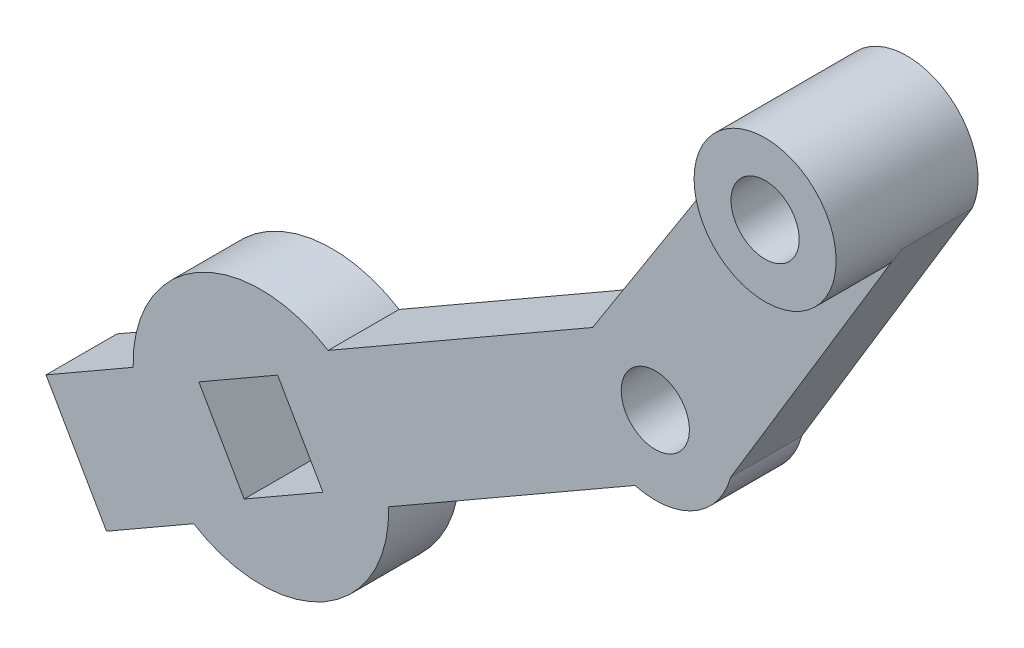
ISO-10303-21;
HEADER;
FILE_DESCRIPTION(('STEP AP214'),'2;1');
FILE_NAME('part.step','',(''),(''),'','','');
FILE_SCHEMA(('AUTOMOTIVE_DESIGN { 1 0 10303 214 1 1 1 1 }'));
ENDSEC;
DATA;
#1=APPLICATION_CONTEXT('core data for automotive mechanical design processes');
#2=APPLICATION_PROTOCOL_DEFINITION('international standard','automotive_design',2000,#1);
#3=PRODUCT_CONTEXT('',#1,'mechanical');
#4=PRODUCT('Part','Part','',(#3));
#5=PRODUCT_RELATED_PRODUCT_CATEGORY('part','',(#4));
#6=PRODUCT_DEFINITION_FORMATION('','',#4);
#7=PRODUCT_DEFINITION_CONTEXT('part definition',#1,'design');
#8=PRODUCT_DEFINITION('design','',#6,#7);
#9=PRODUCT_DEFINITION_SHAPE('','',#8);
#10=(LENGTH_UNIT() NAMED_UNIT(*) SI_UNIT(.MILLI.,.METRE.));
#11=(NAMED_UNIT(*) PLANE_ANGLE_UNIT() SI_UNIT($,.RADIAN.));
#12=(NAMED_UNIT(*) SI_UNIT($,.STERADIAN.) SOLID_ANGLE_UNIT());
#13=UNCERTAINTY_MEASURE_WITH_UNIT(LENGTH_MEASURE(1.E-05),#10,'distance_accuracy_value','');
#14=(GEOMETRIC_REPRESENTATION_CONTEXT(3) GLOBAL_UNCERTAINTY_ASSIGNED_CONTEXT((#13)) GLOBAL_UNIT_ASSIGNED_CONTEXT((#10,
#11,#12)) REPRESENTATION_CONTEXT('',''));
#15=CARTESIAN_POINT('',(0.,0.,0.));
#16=DIRECTION('',(0.,0.,1.));
#17=DIRECTION('',(1.,0.,0.));
#18=AXIS2_PLACEMENT_3D('',#15,#16,#17);
#19=CARTESIAN_POINT('',(0.17625658415401,-0.30648591573246,-5.));
#20=DIRECTION('',(-0.498528903536302,0.866873077410351,0.));
#21=DIRECTION('',(-0.866873077410351,-0.498528903536302,0.));
#22=AXIS2_PLACEMENT_3D('',#19,#20,#21);
#23=PLANE('',#22);
#24=DIRECTION('',(0.,0.,1.));
#25=VECTOR('',#24,1.);
#26=CARTESIAN_POINT('',(-20.556729316369,-12.2297916422161,-30.4558441227157));
#27=LINE('',#26,#25);
#28=CARTESIAN_POINT('',(-20.556729316369,-12.2297916422161,-5.));
#29=VERTEX_POINT('',#28);
#30=CARTESIAN_POINT('',(-20.556729316369,-12.2297916422161,0.));
#31=VERTEX_POINT('',#30);
#32=EDGE_CURVE('E171',#29,#31,#27,.T.);
#33=ORIENTED_EDGE('',*,*,#32,.T.);
#34=DIRECTION('',(0.866873077410351,0.498528903536302,0.));
#35=VECTOR('',#34,1.);
#36=CARTESIAN_POINT('',(0.17625658415401,-0.30648591573246,0.));
#37=LINE('',#36,#35);
#38=CARTESIAN_POINT('',(-1.93424021867878,-1.52020875988425,0.));
#39=VERTEX_POINT('',#38);
#40=EDGE_CURVE('E170',#31,#39,#37,.T.);
#41=ORIENTED_EDGE('',*,*,#40,.T.);
#42=DIRECTION('',(0.,0.,1.));
#43=VECTOR('',#42,1.);
#44=CARTESIAN_POINT('',(-1.93424021867878,-1.52020875988425,-5.));
#45=LINE('',#44,#43);
#46=CARTESIAN_POINT('',(-1.93424021867878,-1.52020875988425,-5.));
#47=VERTEX_POINT('',#46);
#48=EDGE_CURVE('E41',#47,#39,#45,.T.);
#49=ORIENTED_EDGE('',*,*,#48,.F.);
#50=DIRECTION('',(0.866873077410351,0.498528903536302,0.));
#51=VECTOR('',#50,1.);
#52=CARTESIAN_POINT('',(0.17625658415401,-0.30648591573246,-5.));
#53=LINE('',#52,#51);
#54=EDGE_CURVE('E241',#29,#47,#53,.T.);
#55=ORIENTED_EDGE('',*,*,#54,.F.);
#56=EDGE_LOOP('',(#33,#41,#49,#55));
#57=FACE_BOUND('',#56,.T.);
#58=ADVANCED_FACE('F37',(#57),#23,.T.);
#59=CARTESIAN_POINT('',(4.43647181358803,-7.71441323985198,-5.));
#60=DIRECTION('',(-0.498528903536302,0.866873077410351,0.));
#61=DIRECTION('',(-0.866873077410351,-0.498528903536302,0.));
#62=AXIS2_PLACEMENT_3D('',#59,#60,#61);
#63=PLANE('',#62);
#64=DIRECTION('',(0.866873077410351,0.498528903536302,0.));
#65=VECTOR('',#64,1.);
#66=CARTESIAN_POINT('',(4.43647181358803,-7.71441323985198,-5.));
#67=LINE('',#66,#65);
#68=CARTESIAN_POINT('',(-16.296514086935,-19.6377189663356,-5.));
#69=VERTEX_POINT('',#68);
#70=CARTESIAN_POINT('',(1.04782478556533,-9.66318582418271,-5.));
#71=VERTEX_POINT('',#70);
#72=EDGE_CURVE('E244',#69,#71,#67,.T.);
#73=ORIENTED_EDGE('',*,*,#72,.T.);
#74=DIRECTION('',(0.,0.,1.));
#75=VECTOR('',#74,1.);
#76=CARTESIAN_POINT('',(1.04782478556533,-9.66318582418271,-5.));
#77=LINE('',#76,#75);
#78=CARTESIAN_POINT('',(1.04782478556533,-9.66318582418271,0.));
#79=VERTEX_POINT('',#78);
#80=EDGE_CURVE('E199',#71,#79,#77,.T.);
#81=ORIENTED_EDGE('',*,*,#80,.T.);
#82=DIRECTION('',(0.866873077410351,0.498528903536302,0.));
#83=VECTOR('',#82,1.);
#84=CARTESIAN_POINT('',(4.43647181358803,-7.71441323985198,0.));
#85=LINE('',#84,#83);
#86=CARTESIAN_POINT('',(-16.296514086935,-19.6377189663356,0.));
#87=VERTEX_POINT('',#86);
#88=EDGE_CURVE('E185',#87,#79,#85,.T.);
#89=ORIENTED_EDGE('',*,*,#88,.F.);
#90=DIRECTION('',(0.,0.,1.));
#91=VECTOR('',#90,1.);
#92=CARTESIAN_POINT('',(-16.296514086935,-19.6377189663356,-30.4558441227157));
#93=LINE('',#92,#91);
#94=EDGE_CURVE('E236',#69,#87,#93,.T.);
#95=ORIENTED_EDGE('',*,*,#94,.F.);
#96=EDGE_LOOP('',(#73,#81,#89,#95));
#97=FACE_BOUND('',#96,.T.);
#98=ADVANCED_FACE('F270',(#97),#63,.F.);
#99=CARTESIAN_POINT('',(-0.682703439514869,0.436635830889686,-5.));
#100=DIRECTION('',(-0.842436284988127,0.538795977838925,0.));
#101=DIRECTION('',(-0.538795977838925,-0.842436284988127,0.));
#102=AXIS2_PLACEMENT_3D('',#99,#100,#101);
#103=PLANE('',#102);
#104=DIRECTION('',(0.538795977838925,0.842436284988127,0.));
#105=VECTOR('',#104,1.);
#106=CARTESIAN_POINT('',(-0.682703439514869,0.436635830889686,0.));
#107=LINE('',#106,#105);
#108=CARTESIAN_POINT('',(10.6400793801503,18.1404114466345,0.));
#109=VERTEX_POINT('',#108);
#110=EDGE_CURVE('E152',#39,#109,#107,.T.);
#111=ORIENTED_EDGE('',*,*,#110,.T.);
#112=DIRECTION('',(0.,0.,1.));
#113=VECTOR('',#112,1.);
#114=CARTESIAN_POINT('',(10.6400793801503,18.1404114466345,-5.));
#115=LINE('',#114,#113);
#116=CARTESIAN_POINT('',(10.6400793801503,18.1404114466345,-5.));
#117=VERTEX_POINT('',#116);
#118=EDGE_CURVE('E159',#117,#109,#115,.T.);
#119=ORIENTED_EDGE('',*,*,#118,.F.);
#120=DIRECTION('',(0.538795977838925,0.842436284988127,0.));
#121=VECTOR('',#120,1.);
#122=CARTESIAN_POINT('',(-0.682703439514869,0.436635830889686,-5.));
#123=LINE('',#122,#121);
#124=EDGE_CURVE('E192',#47,#117,#123,.T.);
#125=ORIENTED_EDGE('',*,*,#124,.F.);
#126=ORIENTED_EDGE('',*,*,#48,.T.);
#127=EDGE_LOOP('',(#111,#119,#125,#126));
#128=FACE_BOUND('',#127,.T.);
#129=ADVANCED_FACE('F39',(#128),#103,.T.);
#130=DIRECTION('',(0.,0.,1.));
#131=VECTOR('',#130,1.);
#132=CARTESIAN_POINT('',(-34.2898479293558,-20.1275528516411,-30.4558441227157));
#133=LINE('',#132,#131);
#134=CARTESIAN_POINT('',(-34.2898479293558,-20.1275528516411,0.));
#135=VERTEX_POINT('',#134);
#136=CARTESIAN_POINT('',(-34.2898479293558,-20.1275528516411,-5.));
#137=VERTEX_POINT('',#136);
#138=EDGE_CURVE('E176',#135,#137,#133,.F.);
#139=ORIENTED_EDGE('',*,*,#138,.T.);
#140=CARTESIAN_POINT('',(-40.4263847840177,-23.6566057999731,-5.));
#141=VERTEX_POINT('',#140);
#142=EDGE_CURVE('E214',#141,#137,#53,.T.);
#143=ORIENTED_EDGE('',*,*,#142,.F.);
#144=DIRECTION('',(0.,0.,1.));
#145=VECTOR('',#144,1.);
#146=CARTESIAN_POINT('',(-40.4263847840177,-23.6566057999731,-5.));
#147=LINE('',#146,#145);
#148=CARTESIAN_POINT('',(-40.4263847840177,-23.6566057999731,0.));
#149=VERTEX_POINT('',#148);
#150=EDGE_CURVE('E204',#141,#149,#147,.T.);
#151=ORIENTED_EDGE('',*,*,#150,.T.);
#152=EDGE_CURVE('E173',#149,#135,#37,.T.);
#153=ORIENTED_EDGE('',*,*,#152,.T.);
#154=EDGE_LOOP('',(#139,#143,#151,#153));
#155=FACE_BOUND('',#154,.T.);
#156=ADVANCED_FACE('F210',(#155),#23,.T.);
#157=CARTESIAN_POINT('',(-40.6026413681717,-23.3501198842406,-5.));
#158=DIRECTION('',(0.866873077410351,0.498528903536302,0.));
#159=DIRECTION('',(-0.498528903536302,0.866873077410351,0.));
#160=AXIS2_PLACEMENT_3D('',#157,#158,#159);
#161=PLANE('',#160);
#162=DIRECTION('',(0.498528903536302,-0.866873077410351,0.));
#163=VECTOR('',#162,1.);
#164=CARTESIAN_POINT('',(-40.6026413681717,-23.3501198842406,0.));
#165=LINE('',#164,#163);
#166=CARTESIAN_POINT('',(-36.1661695545836,-31.0645331240926,0.));
#167=VERTEX_POINT('',#166);
#168=EDGE_CURVE('E182',#149,#167,#165,.T.);
#169=ORIENTED_EDGE('',*,*,#168,.F.);
#170=ORIENTED_EDGE('',*,*,#150,.F.);
#171=DIRECTION('',(0.498528903536302,-0.866873077410351,0.));
#172=VECTOR('',#171,1.);
#173=CARTESIAN_POINT('',(-40.6026413681717,-23.3501198842406,-5.));
#174=LINE('',#173,#172);
#175=CARTESIAN_POINT('',(-36.1661695545836,-31.0645331240926,-5.));
#176=VERTEX_POINT('',#175);
#177=EDGE_CURVE('E218',#141,#176,#174,.T.);
#178=ORIENTED_EDGE('',*,*,#177,.T.);
#179=DIRECTION('',(0.,0.,1.));
#180=VECTOR('',#179,1.);
#181=CARTESIAN_POINT('',(-36.1661695545836,-31.0645331240926,-5.));
#182=LINE('',#181,#180);
#183=EDGE_CURVE('E202',#176,#167,#182,.T.);
#184=ORIENTED_EDGE('',*,*,#183,.T.);
#185=EDGE_LOOP('',(#169,#170,#178,#184));
#186=FACE_BOUND('',#185,.T.);
#187=ADVANCED_FACE('F217',(#186),#161,.F.);
#188=CARTESIAN_POINT('',(-30.0296326999218,-27.5354801757606,0.));
#189=VERTEX_POINT('',#188);
#190=EDGE_CURVE('E186',#167,#189,#85,.T.);
#191=ORIENTED_EDGE('',*,*,#190,.F.);
#192=ORIENTED_EDGE('',*,*,#183,.F.);
#193=CARTESIAN_POINT('',(-30.0296326999218,-27.5354801757606,-5.));
#194=VERTEX_POINT('',#193);
#195=EDGE_CURVE('E245',#176,#194,#67,.T.);
#196=ORIENTED_EDGE('',*,*,#195,.T.);
#197=DIRECTION('',(0.,0.,1.));
#198=VECTOR('',#197,1.);
#199=CARTESIAN_POINT('',(-30.0296326999218,-27.5354801757606,-30.4558441227157));
#200=LINE('',#199,#198);
#201=EDGE_CURVE('E233',#189,#194,#200,.F.);
#202=ORIENTED_EDGE('',*,*,#201,.F.);
#203=EDGE_LOOP('',(#191,#192,#196,#202));
#204=FACE_BOUND('',#203,.T.);
#205=ADVANCED_FACE('F275',(#204),#63,.F.);
#206=CARTESIAN_POINT('',(2.48034743292827,-4.35301832543163,-5.));
#207=DIRECTION('',(0.,0.,1.));
#208=DIRECTION('',(-1.,0.,0.));
#209=AXIS2_PLACEMENT_3D('',#206,#207,#208);
#210=CYLINDRICAL_SURFACE('',#209,5.5);
#211=CARTESIAN_POINT('',(2.48034743292827,-4.35301832543163,0.));
#212=DIRECTION('',(0.,0.,1.));
#213=DIRECTION('',(1.,0.,0.));
#214=AXIS2_PLACEMENT_3D('',#211,#212,#213);
#215=CIRCLE('',#214,5.5);
#216=CARTESIAN_POINT('',(7.79051493167935,-5.78554097279456,0.));
#217=VERTEX_POINT('',#216);
#218=EDGE_CURVE('E189',#79,#217,#215,.T.);
#219=ORIENTED_EDGE('',*,*,#218,.F.);
#220=ORIENTED_EDGE('',*,*,#80,.F.);
#221=CARTESIAN_POINT('',(2.48034743292827,-4.35301832543163,-5.));
#222=DIRECTION('',(0.,0.,1.));
#223=DIRECTION('',(1.,0.,0.));
#224=AXIS2_PLACEMENT_3D('',#221,#222,#223);
#225=CIRCLE('',#224,5.5);
#226=CARTESIAN_POINT('',(7.79051493167935,-5.78554097279456,-5.));
#227=VERTEX_POINT('',#226);
#228=EDGE_CURVE('E248',#71,#227,#225,.T.);
#229=ORIENTED_EDGE('',*,*,#228,.T.);
#230=DIRECTION('',(0.,0.,1.));
#231=VECTOR('',#230,1.);
#232=CARTESIAN_POINT('',(7.79051493167935,-5.78554097279456,-5.));
#233=LINE('',#232,#231);
#234=EDGE_CURVE('E196',#227,#217,#233,.T.);
#235=ORIENTED_EDGE('',*,*,#234,.T.);
#236=EDGE_LOOP('',(#219,#220,#229,#235));
#237=FACE_BOUND('',#236,.T.);
#238=ADVANCED_FACE('F264',(#237),#210,.T.);
#239=CARTESIAN_POINT('',(8.27057905312399,-4.98984292672802,-5.));
#240=DIRECTION('',(-0.856234541670631,0.51658727205583,0.));
#241=DIRECTION('',(-0.51658727205583,-0.856234541670632,0.));
#242=AXIS2_PLACEMENT_3D('',#239,#240,#241);
#243=PLANE('',#242);
#244=DIRECTION('',(0.51658727205583,0.856234541670631,0.));
#245=VECTOR('',#244,1.);
#246=CARTESIAN_POINT('',(8.27057905312399,-4.98984292672802,0.));
#247=LINE('',#246,#245);
#248=CARTESIAN_POINT('',(19.1338806378452,13.0158930961649,0.));
#249=VERTEX_POINT('',#248);
#250=EDGE_CURVE('E155',#217,#249,#247,.T.);
#251=ORIENTED_EDGE('',*,*,#250,.F.);
#252=ORIENTED_EDGE('',*,*,#234,.F.);
#253=DIRECTION('',(0.51658727205583,0.856234541670631,0.));
#254=VECTOR('',#253,1.);
#255=CARTESIAN_POINT('',(8.27057905312399,-4.98984292672802,-5.));
#256=LINE('',#255,#254);
#257=CARTESIAN_POINT('',(19.7862245967424,14.097142017446,-5.));
#258=VERTEX_POINT('',#257);
#259=EDGE_CURVE('E250',#227,#258,#256,.T.);
#260=ORIENTED_EDGE('',*,*,#259,.T.);
#261=DIRECTION('',(0.,0.,1.));
#262=VECTOR('',#261,1.);
#263=CARTESIAN_POINT('',(19.7862245967424,14.097142017446,-5.));
#264=LINE('',#263,#262);
#265=CARTESIAN_POINT('',(19.7862245967424,14.097142017446,0.));
#266=VERTEX_POINT('',#265);
#267=EDGE_CURVE('E166',#258,#266,#264,.T.);
#268=ORIENTED_EDGE('',*,*,#267,.T.);
#269=EDGE_CURVE('E191',#249,#266,#247,.T.);
#270=ORIENTED_EDGE('',*,*,#269,.F.);
#271=EDGE_LOOP('',(#251,#252,#260,#268,#270));
#272=FACE_BOUND('',#271,.T.);
#273=ADVANCED_FACE('F254',(#272),#243,.F.);
#274=CARTESIAN_POINT('',(15.2131519884464,16.1187767320402,-5.));
#275=DIRECTION('',(0.,0.,1.));
#276=DIRECTION('',(-1.,0.,0.));
#277=AXIS2_PLACEMENT_3D('',#274,#275,#276);
#278=CYLINDRICAL_SURFACE('',#277,5.);
#279=ORIENTED_EDGE('',*,*,#267,.F.);
#280=CARTESIAN_POINT('',(15.2131519884464,16.1187767320402,-5.));
#281=DIRECTION('',(0.,0.,1.));
#282=DIRECTION('',(1.,0.,0.));
#283=AXIS2_PLACEMENT_3D('',#280,#281,#282);
#284=CIRCLE('',#283,5.);
#285=EDGE_CURVE('E163',#258,#117,#284,.T.);
#286=ORIENTED_EDGE('',*,*,#285,.T.);
#287=ORIENTED_EDGE('',*,*,#118,.T.);
#288=CARTESIAN_POINT('',(15.2131519884464,16.1187767320402,0.));
#289=DIRECTION('',(0.,0.,-1.));
#290=DIRECTION('',(-1.,0.,0.));
#291=AXIS2_PLACEMENT_3D('',#288,#289,#290);
#292=CIRCLE('',#291,5.);
#293=EDGE_CURVE('E11',#249,#109,#292,.T.);
#294=ORIENTED_EDGE('',*,*,#293,.F.);
#295=EDGE_CURVE('E47',#266,#249,#292,.T.);
#296=ORIENTED_EDGE('',*,*,#295,.F.);
#297=EDGE_LOOP('',(#279,#286,#287,#294,#296));
#298=FACE_BOUND('',#297,.T.);
#299=CARTESIAN_POINT('',(15.2131519884464,16.1187767320402,5.));
#300=DIRECTION('',(0.,0.,-1.));
#301=DIRECTION('',(-1.,0.,0.));
#302=AXIS2_PLACEMENT_3D('',#299,#300,#301);
#303=CIRCLE('',#302,5.);
#304=CARTESIAN_POINT('',(10.2131519884464,16.1187767320402,5.));
#305=VERTEX_POINT('',#304);
#306=EDGE_CURVE('E260',#305,#305,#303,.T.);
#307=ORIENTED_EDGE('',*,*,#306,.T.);
#308=EDGE_LOOP('',(#307));
#309=FACE_BOUND('',#308,.T.);
#310=ADVANCED_FACE('F161',(#298,#309),#278,.T.);
#311=CARTESIAN_POINT('',(0.,0.,-5.));
#312=DIRECTION('',(0.,0.,-1.));
#313=DIRECTION('',(1.,0.,0.));
#314=AXIS2_PLACEMENT_3D('',#311,#312,#313);
#315=PLANE('',#314);
#316=CARTESIAN_POINT('',(2.48034743292827,-4.35301832543163,-5.));
#317=DIRECTION('',(0.,0.,1.));
#318=DIRECTION('',(1.,0.,0.));
#319=AXIS2_PLACEMENT_3D('',#316,#317,#318);
#320=CIRCLE('',#319,2.4);
#321=CARTESIAN_POINT('',(4.88034743292827,-4.35301832543163,-5.));
#322=VERTEX_POINT('',#321);
#323=EDGE_CURVE('E493',#322,#322,#320,.F.);
#324=ORIENTED_EDGE('',*,*,#323,.F.);
#325=EDGE_LOOP('',(#324));
#326=FACE_BOUND('',#325,.T.);
#327=CARTESIAN_POINT('',(15.2131519884464,16.1187767320402,-5.));
#328=DIRECTION('',(0.,0.,1.));
#329=DIRECTION('',(1.,0.,0.));
#330=AXIS2_PLACEMENT_3D('',#327,#328,#329);
#331=CIRCLE('',#330,2.4);
#332=CARTESIAN_POINT('',(17.6131519884464,16.1187767320402,-5.));
#333=VERTEX_POINT('',#332);
#334=EDGE_CURVE('E497',#333,#333,#331,.F.);
#335=ORIENTED_EDGE('',*,*,#334,.F.);
#336=EDGE_LOOP('',(#335));
#337=FACE_BOUND('',#336,.T.);
#338=DIRECTION('',(-0.866873077410351,-0.498528903536302,0.));
#339=VECTOR('',#338,1.);
#340=CARTESIAN_POINT('',(-26.4718823645424,-24.2519222480176,-5.));
#341=LINE('',#340,#339);
#342=CARTESIAN_POINT('',(-20.9238946691161,-21.0613372653853,-5.));
#343=VERTEX_POINT('',#342);
#344=CARTESIAN_POINT('',(-26.4718823645424,-24.2519222480176,-5.));
#345=VERTEX_POINT('',#344);
#346=EDGE_CURVE('E518',#343,#345,#341,.T.);
#347=ORIENTED_EDGE('',*,*,#346,.F.);
#348=DIRECTION('',(0.498528903536302,-0.866873077410351,0.));
#349=VECTOR('',#348,1.);
#350=CARTESIAN_POINT('',(-20.9238946691161,-21.0613372653853,-5.));
#351=LINE('',#350,#349);
#352=CARTESIAN_POINT('',(-24.1144796517484,-15.513349569959,-5.));
#353=VERTEX_POINT('',#352);
#354=EDGE_CURVE('E515',#353,#343,#351,.T.);
#355=ORIENTED_EDGE('',*,*,#354,.F.);
#356=DIRECTION('',(0.866873077410351,0.498528903536302,0.));
#357=VECTOR('',#356,1.);
#358=CARTESIAN_POINT('',(-29.6624673471747,-18.7039345525914,-5.));
#359=LINE('',#358,#357);
#360=CARTESIAN_POINT('',(-29.6624673471747,-18.7039345525914,-5.));
#361=VERTEX_POINT('',#360);
#362=EDGE_CURVE('E511',#361,#353,#359,.T.);
#363=ORIENTED_EDGE('',*,*,#362,.F.);
#364=DIRECTION('',(-0.498528903536302,0.866873077410351,0.));
#365=VECTOR('',#364,1.);
#366=CARTESIAN_POINT('',(-26.4718823645424,-24.2519222480176,-5.));
#367=LINE('',#366,#365);
#368=EDGE_CURVE('E224',#345,#361,#367,.T.);
#369=ORIENTED_EDGE('',*,*,#368,.F.);
#370=EDGE_LOOP('',(#347,#355,#363,#369));
#371=FACE_BOUND('',#370,.T.);
#372=ORIENTED_EDGE('',*,*,#195,.F.);
#373=ORIENTED_EDGE('',*,*,#177,.F.);
#374=ORIENTED_EDGE('',*,*,#142,.T.);
#375=CARTESIAN_POINT('',(-25.2931810081454,-19.8826359089883,-5.));
#376=DIRECTION('',(0.,0.,1.));
#377=DIRECTION('',(1.,0.,0.));
#378=AXIS2_PLACEMENT_3D('',#375,#376,#377);
#379=CIRCLE('',#378,9.);
#380=EDGE_CURVE('E232',#137,#29,#379,.F.);
#381=ORIENTED_EDGE('',*,*,#380,.T.);
#382=ORIENTED_EDGE('',*,*,#54,.T.);
#383=ORIENTED_EDGE('',*,*,#124,.T.);
#384=ORIENTED_EDGE('',*,*,#285,.F.);
#385=ORIENTED_EDGE('',*,*,#259,.F.);
#386=ORIENTED_EDGE('',*,*,#228,.F.);
#387=ORIENTED_EDGE('',*,*,#72,.F.);
#388=EDGE_CURVE('E226',#69,#194,#379,.F.);
#389=ORIENTED_EDGE('',*,*,#388,.T.);
#390=EDGE_LOOP('',(#372,#373,#374,#381,#382,#383,#384,#385,#386,#387,#389));
#391=FACE_BOUND('',#390,.T.);
#392=ADVANCED_FACE('F256',(#326,#337,#371,#391),#315,.T.);
#393=CARTESIAN_POINT('',(0.,0.,0.));
#394=DIRECTION('',(0.,0.,-1.));
#395=DIRECTION('',(1.,0.,0.));
#396=AXIS2_PLACEMENT_3D('',#393,#394,#395);
#397=PLANE('',#396);
#398=CARTESIAN_POINT('',(2.48034743292827,-4.35301832543163,0.));
#399=DIRECTION('',(0.,0.,-1.));
#400=DIRECTION('',(-1.,0.,0.));
#401=AXIS2_PLACEMENT_3D('',#398,#399,#400);
#402=CIRCLE('',#401,2.4);
#403=CARTESIAN_POINT('',(0.0803474329282672,-4.35301832543163,0.));
#404=VERTEX_POINT('',#403);
#405=EDGE_CURVE('E496',#404,#404,#402,.T.);
#406=ORIENTED_EDGE('',*,*,#405,.T.);
#407=EDGE_LOOP('',(#406));
#408=FACE_BOUND('',#407,.T.);
#409=ORIENTED_EDGE('',*,*,#293,.T.);
#410=ORIENTED_EDGE('',*,*,#110,.F.);
#411=ORIENTED_EDGE('',*,*,#40,.F.);
#412=CARTESIAN_POINT('',(-25.2931810081454,-19.8826359089883,0.));
#413=DIRECTION('',(0.,0.,-1.));
#414=DIRECTION('',(-1.,0.,0.));
#415=AXIS2_PLACEMENT_3D('',#412,#413,#414);
#416=CIRCLE('',#415,9.);
#417=EDGE_CURVE('E220',#135,#31,#416,.T.);
#418=ORIENTED_EDGE('',*,*,#417,.F.);
#419=ORIENTED_EDGE('',*,*,#152,.F.);
#420=ORIENTED_EDGE('',*,*,#168,.T.);
#421=ORIENTED_EDGE('',*,*,#190,.T.);
#422=EDGE_CURVE('E223',#87,#189,#416,.T.);
#423=ORIENTED_EDGE('',*,*,#422,.F.);
#424=ORIENTED_EDGE('',*,*,#88,.T.);
#425=ORIENTED_EDGE('',*,*,#218,.T.);
#426=ORIENTED_EDGE('',*,*,#250,.T.);
#427=EDGE_LOOP('',(#409,#410,#411,#418,#419,#420,#421,#423,#424,#425,#426));
#428=FACE_BOUND('',#427,.T.);
#429=DIRECTION('',(-0.498528903536302,0.866873077410351,0.));
#430=VECTOR('',#429,1.);
#431=CARTESIAN_POINT('',(-26.4718823645424,-24.2519222480176,0.));
#432=LINE('',#431,#430);
#433=CARTESIAN_POINT('',(-26.4718823645424,-24.2519222480176,0.));
#434=VERTEX_POINT('',#433);
#435=CARTESIAN_POINT('',(-29.6624673471747,-18.7039345525914,0.));
#436=VERTEX_POINT('',#435);
#437=EDGE_CURVE('E524',#434,#436,#432,.T.);
#438=ORIENTED_EDGE('',*,*,#437,.T.);
#439=DIRECTION('',(0.866873077410351,0.498528903536302,0.));
#440=VECTOR('',#439,1.);
#441=CARTESIAN_POINT('',(-29.6624673471747,-18.7039345525914,0.));
#442=LINE('',#441,#440);
#443=CARTESIAN_POINT('',(-24.1144796517484,-15.513349569959,0.));
#444=VERTEX_POINT('',#443);
#445=EDGE_CURVE('E527',#436,#444,#442,.T.);
#446=ORIENTED_EDGE('',*,*,#445,.T.);
#447=DIRECTION('',(0.498528903536302,-0.866873077410351,0.));
#448=VECTOR('',#447,1.);
#449=CARTESIAN_POINT('',(-20.9238946691161,-21.0613372653853,0.));
#450=LINE('',#449,#448);
#451=CARTESIAN_POINT('',(-20.9238946691161,-21.0613372653853,0.));
#452=VERTEX_POINT('',#451);
#453=EDGE_CURVE('E530',#444,#452,#450,.T.);
#454=ORIENTED_EDGE('',*,*,#453,.T.);
#455=DIRECTION('',(-0.866873077410351,-0.498528903536301,0.));
#456=VECTOR('',#455,1.);
#457=CARTESIAN_POINT('',(-26.4718823645424,-24.2519222480176,0.));
#458=LINE('',#457,#456);
#459=EDGE_CURVE('E521',#452,#434,#458,.T.);
#460=ORIENTED_EDGE('',*,*,#459,.T.);
#461=EDGE_LOOP('',(#438,#446,#454,#460));
#462=FACE_BOUND('',#461,.T.);
#463=ADVANCED_FACE('F148',(#408,#428,#462),#397,.F.);
#464=CARTESIAN_POINT('',(-25.2931810081454,-19.8826359089883,-30.4558441227157));
#465=DIRECTION('',(0.,0.,1.));
#466=DIRECTION('',(-1.,0.,0.));
#467=AXIS2_PLACEMENT_3D('',#464,#465,#466);
#468=CYLINDRICAL_SURFACE('',#467,9.);
#469=ORIENTED_EDGE('',*,*,#94,.T.);
#470=ORIENTED_EDGE('',*,*,#422,.T.);
#471=ORIENTED_EDGE('',*,*,#201,.T.);
#472=ORIENTED_EDGE('',*,*,#388,.F.);
#473=EDGE_LOOP('',(#469,#470,#471,#472));
#474=FACE_BOUND('',#473,.T.);
#475=ADVANCED_FACE('F273',(#474),#468,.T.);
#476=ORIENTED_EDGE('',*,*,#380,.F.);
#477=ORIENTED_EDGE('',*,*,#138,.F.);
#478=ORIENTED_EDGE('',*,*,#417,.T.);
#479=ORIENTED_EDGE('',*,*,#32,.F.);
#480=EDGE_LOOP('',(#476,#477,#478,#479));
#481=FACE_BOUND('',#480,.T.);
#482=ADVANCED_FACE('F378',(#481),#468,.T.);
#483=CARTESIAN_POINT('',(-26.4718823645424,-24.2519222480176,-5.001));
#484=DIRECTION('',(0.498528903536301,-0.866873077410351,0.));
#485=DIRECTION('',(0.866873077410351,0.498528903536302,0.));
#486=AXIS2_PLACEMENT_3D('',#483,#484,#485);
#487=PLANE('',#486);
#488=DIRECTION('',(0.,0.,1.));
#489=VECTOR('',#488,1.);
#490=CARTESIAN_POINT('',(-20.9238946691161,-21.0613372653853,-5.001));
#491=LINE('',#490,#489);
#492=EDGE_CURVE('E227',#343,#452,#491,.T.);
#493=ORIENTED_EDGE('',*,*,#492,.F.);
#494=ORIENTED_EDGE('',*,*,#346,.T.);
#495=DIRECTION('',(0.,0.,1.));
#496=VECTOR('',#495,1.);
#497=CARTESIAN_POINT('',(-26.4718823645424,-24.2519222480176,-5.001));
#498=LINE('',#497,#496);
#499=EDGE_CURVE('E533',#345,#434,#498,.T.);
#500=ORIENTED_EDGE('',*,*,#499,.T.);
#501=ORIENTED_EDGE('',*,*,#459,.F.);
#502=EDGE_LOOP('',(#493,#494,#500,#501));
#503=FACE_BOUND('',#502,.T.);
#504=ADVANCED_FACE('F386',(#503),#487,.F.);
#505=CARTESIAN_POINT('',(-20.9238946691161,-21.0613372653853,-5.001));
#506=DIRECTION('',(0.866873077410351,0.498528903536302,0.));
#507=DIRECTION('',(-0.498528903536302,0.866873077410351,0.));
#508=AXIS2_PLACEMENT_3D('',#505,#506,#507);
#509=PLANE('',#508);
#510=CARTESIAN_POINT('',(-22.5191871604323,-18.2873434176722,-2.5));
#511=DIRECTION('',(0.866873077410351,0.498528903536302,0.));
#512=DIRECTION('',(0.498528903536302,-0.866873077410351,0.));
#513=AXIS2_PLACEMENT_3D('',#510,#511,#512);
#514=CIRCLE('',#513,1.);
#515=CARTESIAN_POINT('',(-22.020658256896,-19.1542164950825,-2.5));
#516=VERTEX_POINT('',#515);
#517=EDGE_CURVE('E506',#516,#516,#514,.T.);
#518=ORIENTED_EDGE('',*,*,#517,.T.);
#519=EDGE_LOOP('',(#518));
#520=FACE_BOUND('',#519,.T.);
#521=DIRECTION('',(0.,0.,1.));
#522=VECTOR('',#521,1.);
#523=CARTESIAN_POINT('',(-24.1144796517484,-15.513349569959,-5.001));
#524=LINE('',#523,#522);
#525=EDGE_CURVE('E535',#353,#444,#524,.T.);
#526=ORIENTED_EDGE('',*,*,#525,.F.);
#527=ORIENTED_EDGE('',*,*,#354,.T.);
#528=ORIENTED_EDGE('',*,*,#492,.T.);
#529=ORIENTED_EDGE('',*,*,#453,.F.);
#530=EDGE_LOOP('',(#526,#527,#528,#529));
#531=FACE_BOUND('',#530,.T.);
#532=ADVANCED_FACE('F393',(#520,#531),#509,.F.);
#533=CARTESIAN_POINT('',(-29.6624673471747,-18.7039345525914,-5.001));
#534=DIRECTION('',(-0.498528903536302,0.866873077410351,0.));
#535=DIRECTION('',(-0.866873077410351,-0.498528903536302,0.));
#536=AXIS2_PLACEMENT_3D('',#533,#534,#535);
#537=PLANE('',#536);
#538=DIRECTION('',(0.,0.,1.));
#539=VECTOR('',#538,1.);
#540=CARTESIAN_POINT('',(-29.6624673471747,-18.7039345525914,-5.001));
#541=LINE('',#540,#539);
#542=EDGE_CURVE('E60',#361,#436,#541,.T.);
#543=ORIENTED_EDGE('',*,*,#542,.F.);
#544=ORIENTED_EDGE('',*,*,#362,.T.);
#545=ORIENTED_EDGE('',*,*,#525,.T.);
#546=ORIENTED_EDGE('',*,*,#445,.F.);
#547=EDGE_LOOP('',(#543,#544,#545,#546));
#548=FACE_BOUND('',#547,.T.);
#549=ADVANCED_FACE('F402',(#548),#537,.F.);
#550=CARTESIAN_POINT('',(-26.4718823645424,-24.2519222480176,-5.001));
#551=DIRECTION('',(-0.866873077410351,-0.498528903536302,0.));
#552=DIRECTION('',(0.498528903536302,-0.866873077410351,0.));
#553=AXIS2_PLACEMENT_3D('',#550,#551,#552);
#554=PLANE('',#553);
#555=ORIENTED_EDGE('',*,*,#499,.F.);
#556=ORIENTED_EDGE('',*,*,#368,.T.);
#557=ORIENTED_EDGE('',*,*,#542,.T.);
#558=ORIENTED_EDGE('',*,*,#437,.F.);
#559=EDGE_LOOP('',(#555,#556,#557,#558));
#560=FACE_BOUND('',#559,.T.);
#561=ADVANCED_FACE('F411',(#560),#554,.F.);
#562=CARTESIAN_POINT('',(-22.0857506217271,-18.038078965904,-2.5));
#563=DIRECTION('',(-0.866873077410351,-0.498528903536302,0.));
#564=DIRECTION('',(0.498528903536302,-0.866873077410351,0.));
#565=AXIS2_PLACEMENT_3D('',#562,#563,#564);
#566=CYLINDRICAL_SURFACE('',#565,1.);
#567=CARTESIAN_POINT('',(-22.0857506217271,-18.038078965904,-2.5));
#568=DIRECTION('',(0.866873077410351,0.498528903536302,0.));
#569=DIRECTION('',(0.498528903536302,-0.866873077410351,0.));
#570=AXIS2_PLACEMENT_3D('',#567,#568,#569);
#571=CIRCLE('',#570,1.);
#572=CARTESIAN_POINT('',(-21.5872217181908,-18.9049520433144,-2.5));
#573=VERTEX_POINT('',#572);
#574=EDGE_CURVE('E508',#573,#573,#571,.T.);
#575=ORIENTED_EDGE('',*,*,#574,.T.);
#576=EDGE_LOOP('',(#575));
#577=FACE_BOUND('',#576,.T.);
#578=ORIENTED_EDGE('',*,*,#517,.F.);
#579=EDGE_LOOP('',(#578));
#580=FACE_BOUND('',#579,.T.);
#581=ADVANCED_FACE('F419',(#577,#580),#566,.F.);
#582=CARTESIAN_POINT('',(-22.0857506217271,-18.038078965904,-2.5));
#583=DIRECTION('',(-0.866873077410351,-0.498528903536302,0.));
#584=DIRECTION('',(0.498528903536302,-0.866873077410351,0.));
#585=AXIS2_PLACEMENT_3D('',#582,#583,#584);
#586=PLANE('',#585);
#587=ORIENTED_EDGE('',*,*,#574,.F.);
#588=EDGE_LOOP('',(#587));
#589=FACE_BOUND('',#588,.T.);
#590=ADVANCED_FACE('F428',(#589),#586,.T.);
#591=CARTESIAN_POINT('',(15.2131519884464,16.1187767320402,5.));
#592=DIRECTION('',(0.,0.,1.));
#593=DIRECTION('',(-1.,0.,0.));
#594=AXIS2_PLACEMENT_3D('',#591,#592,#593);
#595=PLANE('',#594);
#596=CARTESIAN_POINT('',(15.2131519884464,16.1187767320402,5.));
#597=DIRECTION('',(0.,0.,-1.));
#598=DIRECTION('',(-1.,0.,0.));
#599=AXIS2_PLACEMENT_3D('',#596,#597,#598);
#600=CIRCLE('',#599,2.4);
#601=CARTESIAN_POINT('',(12.8131519884464,16.1187767320402,5.));
#602=VERTEX_POINT('',#601);
#603=EDGE_CURVE('E261',#602,#602,#600,.T.);
#604=ORIENTED_EDGE('',*,*,#603,.T.);
#605=EDGE_LOOP('',(#604));
#606=FACE_BOUND('',#605,.T.);
#607=ORIENTED_EDGE('',*,*,#306,.F.);
#608=EDGE_LOOP('',(#607));
#609=FACE_BOUND('',#608,.T.);
#610=ADVANCED_FACE('F437',(#606,#609),#595,.T.);
#611=CARTESIAN_POINT('',(15.2131519884464,16.1187767320402,0.));
#612=DIRECTION('',(0.,0.,1.));
#613=DIRECTION('',(-1.,0.,0.));
#614=AXIS2_PLACEMENT_3D('',#611,#612,#613);
#615=PLANE('',#614);
#616=ORIENTED_EDGE('',*,*,#269,.T.);
#617=ORIENTED_EDGE('',*,*,#295,.T.);
#618=EDGE_LOOP('',(#616,#617));
#619=FACE_BOUND('',#618,.T.);
#620=ADVANCED_FACE('F262',(#619),#615,.F.);
#621=CARTESIAN_POINT('',(15.2131519884464,16.1187767320402,-5.001));
#622=DIRECTION('',(0.,0.,1.));
#623=DIRECTION('',(-1.,0.,0.));
#624=AXIS2_PLACEMENT_3D('',#621,#622,#623);
#625=CYLINDRICAL_SURFACE('',#624,2.4);
#626=ORIENTED_EDGE('',*,*,#334,.T.);
#627=EDGE_LOOP('',(#626));
#628=FACE_BOUND('',#627,.T.);
#629=ORIENTED_EDGE('',*,*,#603,.F.);
#630=EDGE_LOOP('',(#629));
#631=FACE_BOUND('',#630,.T.);
#632=ADVANCED_FACE('F454',(#628,#631),#625,.F.);
#633=CARTESIAN_POINT('',(2.48034743292827,-4.35301832543163,-5.001));
#634=DIRECTION('',(0.,0.,1.));
#635=DIRECTION('',(-1.,0.,0.));
#636=AXIS2_PLACEMENT_3D('',#633,#634,#635);
#637=CYLINDRICAL_SURFACE('',#636,2.4);
#638=ORIENTED_EDGE('',*,*,#323,.T.);
#639=EDGE_LOOP('',(#638));
#640=FACE_BOUND('',#639,.T.);
#641=ORIENTED_EDGE('',*,*,#405,.F.);
#642=EDGE_LOOP('',(#641));
#643=FACE_BOUND('',#642,.T.);
#644=ADVANCED_FACE('F462',(#640,#643),#637,.F.);
#645=CLOSED_SHELL('',(#58,#98,#129,#156,#187,#205,#238,#273,#310,#392,#463,#475,#482,#504,#532,
#549,#561,#581,#590,#610,#620,#632,#644));
#646=MANIFOLD_SOLID_BREP('B2',#645);
#647=ADVANCED_BREP_SHAPE_REPRESENTATION('',(#18,#646),#14);
#648=SHAPE_DEFINITION_REPRESENTATION(#9,#647);
ENDSEC;
END-ISO-10303-21;
